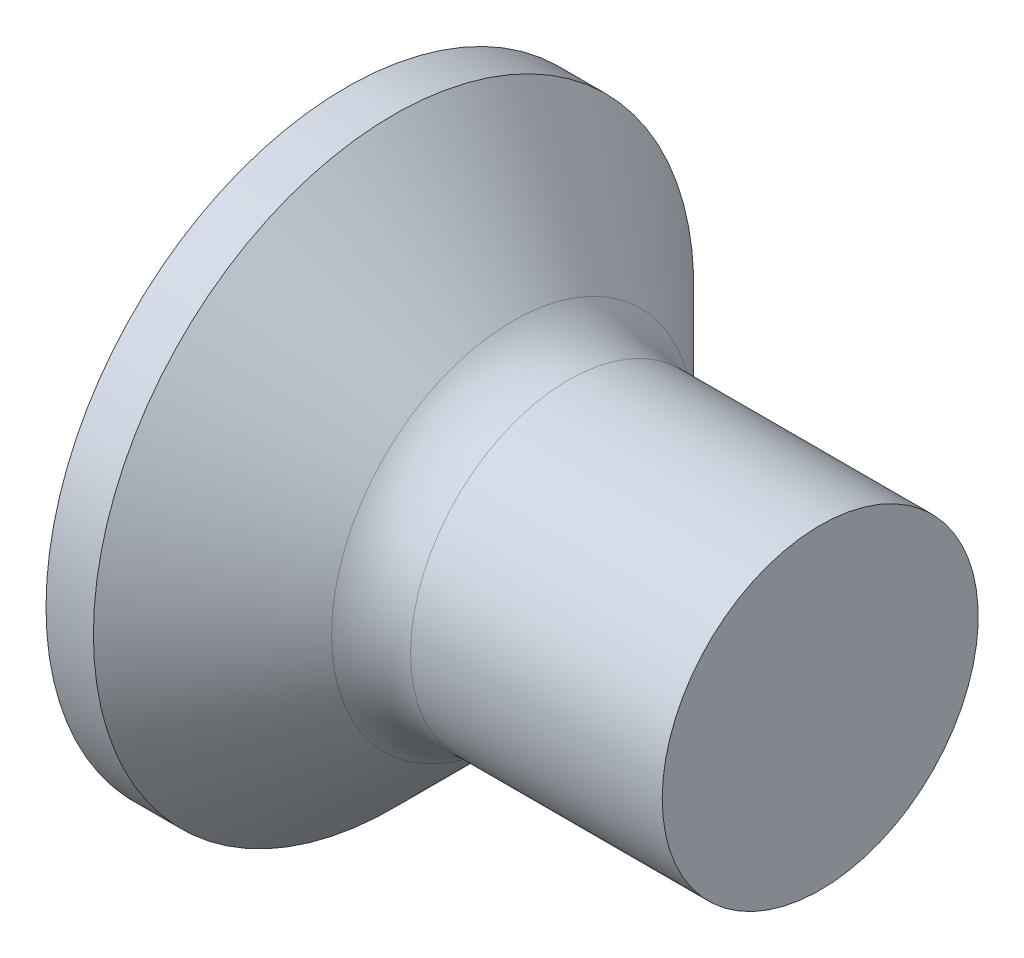
ISO-10303-21;
HEADER;
FILE_DESCRIPTION(('STEP AP214'),'2;1');
FILE_NAME('part.step','',(''),(''),'','','');
FILE_SCHEMA(('AUTOMOTIVE_DESIGN { 1 0 10303 214 1 1 1 1 }'));
ENDSEC;
DATA;
#1=APPLICATION_CONTEXT('core data for automotive mechanical design processes');
#2=APPLICATION_PROTOCOL_DEFINITION('international standard','automotive_design',2000,#1);
#3=PRODUCT_CONTEXT('',#1,'mechanical');
#4=PRODUCT('Part','Part','',(#3));
#5=PRODUCT_RELATED_PRODUCT_CATEGORY('part','',(#4));
#6=PRODUCT_DEFINITION_FORMATION('','',#4);
#7=PRODUCT_DEFINITION_CONTEXT('part definition',#1,'design');
#8=PRODUCT_DEFINITION('design','',#6,#7);
#9=PRODUCT_DEFINITION_SHAPE('','',#8);
#10=(LENGTH_UNIT() NAMED_UNIT(*) SI_UNIT(.MILLI.,.METRE.));
#11=(NAMED_UNIT(*) PLANE_ANGLE_UNIT() SI_UNIT($,.RADIAN.));
#12=(NAMED_UNIT(*) SI_UNIT($,.STERADIAN.) SOLID_ANGLE_UNIT());
#13=UNCERTAINTY_MEASURE_WITH_UNIT(LENGTH_MEASURE(1.E-05),#10,'distance_accuracy_value','');
#14=(GEOMETRIC_REPRESENTATION_CONTEXT(3) GLOBAL_UNCERTAINTY_ASSIGNED_CONTEXT((#13)) GLOBAL_UNIT_ASSIGNED_CONTEXT((#10,
#11,#12)) REPRESENTATION_CONTEXT('',''));
#15=CARTESIAN_POINT('',(0.,0.,0.));
#16=DIRECTION('',(0.,0.,1.));
#17=DIRECTION('',(1.,0.,0.));
#18=AXIS2_PLACEMENT_3D('',#15,#16,#17);
#19=CARTESIAN_POINT('',(0.,0.,0.));
#20=DIRECTION('',(-1.,0.,0.));
#21=DIRECTION('',(0.,0.,1.));
#22=AXIS2_PLACEMENT_3D('',#19,#20,#21);
#23=PLANE('',#22);
#24=CARTESIAN_POINT('',(0.,0.,0.));
#25=DIRECTION('',(-1.,0.,0.));
#26=DIRECTION('',(0.,0.,1.));
#27=AXIS2_PLACEMENT_3D('',#24,#25,#26);
#28=CIRCLE('',#27,1.9);
#29=CARTESIAN_POINT('',(0.,0.,1.9));
#30=VERTEX_POINT('',#29);
#31=EDGE_CURVE('E338',#30,#30,#28,.T.);
#32=ORIENTED_EDGE('',*,*,#31,.T.);
#33=EDGE_LOOP('',(#32));
#34=FACE_BOUND('',#33,.T.);
#35=DIRECTION('',(0.,0.,-1.));
#36=VECTOR('',#35,1.);
#37=CARTESIAN_POINT('',(0.,-0.240000000000003,0.95));
#38=LINE('',#37,#36);
#39=CARTESIAN_POINT('',(0.,-0.240000000000003,0.95));
#40=VERTEX_POINT('',#39);
#41=CARTESIAN_POINT('',(0.,-0.24,0.368080234393744));
#42=VERTEX_POINT('',#41);
#43=EDGE_CURVE('E378',#40,#42,#38,.T.);
#44=ORIENTED_EDGE('',*,*,#43,.T.);
#45=CARTESIAN_POINT('',(0.,0.,0.));
#46=DIRECTION('',(-1.,0.,0.));
#47=DIRECTION('',(0.,0.,1.));
#48=AXIS2_PLACEMENT_3D('',#45,#46,#47);
#49=CIRCLE('',#48,0.439412174332202);
#50=CARTESIAN_POINT('',(0.,-0.368080234393744,0.24));
#51=VERTEX_POINT('',#50);
#52=EDGE_CURVE('E366',#51,#42,#49,.T.);
#53=ORIENTED_EDGE('',*,*,#52,.F.);
#54=DIRECTION('',(0.,-1.,0.));
#55=VECTOR('',#54,1.);
#56=CARTESIAN_POINT('',(0.,0.95,0.24));
#57=LINE('',#56,#55);
#58=CARTESIAN_POINT('',(0.,-0.95,0.24));
#59=VERTEX_POINT('',#58);
#60=EDGE_CURVE('E425',#51,#59,#57,.T.);
#61=ORIENTED_EDGE('',*,*,#60,.T.);
#62=DIRECTION('',(0.,0.,-1.));
#63=VECTOR('',#62,1.);
#64=CARTESIAN_POINT('',(0.,-0.95,0.24));
#65=LINE('',#64,#63);
#66=CARTESIAN_POINT('',(0.,-0.95,-0.24));
#67=VERTEX_POINT('',#66);
#68=EDGE_CURVE('E335',#59,#67,#65,.T.);
#69=ORIENTED_EDGE('',*,*,#68,.T.);
#70=DIRECTION('',(0.,1.,0.));
#71=VECTOR('',#70,1.);
#72=CARTESIAN_POINT('',(0.,-0.95,-0.24));
#73=LINE('',#72,#71);
#74=CARTESIAN_POINT('',(0.,-0.368080234393745,-0.24));
#75=VERTEX_POINT('',#74);
#76=EDGE_CURVE('E426',#67,#75,#73,.T.);
#77=ORIENTED_EDGE('',*,*,#76,.T.);
#78=CARTESIAN_POINT('',(0.,-0.24,-0.368080234393745));
#79=VERTEX_POINT('',#78);
#80=EDGE_CURVE('E372',#79,#75,#49,.T.);
#81=ORIENTED_EDGE('',*,*,#80,.F.);
#82=CARTESIAN_POINT('',(0.,-0.239999999999997,-0.95));
#83=VERTEX_POINT('',#82);
#84=EDGE_CURVE('E387',#79,#83,#38,.T.);
#85=ORIENTED_EDGE('',*,*,#84,.T.);
#86=DIRECTION('',(0.,1.,0.));
#87=VECTOR('',#86,1.);
#88=CARTESIAN_POINT('',(0.,-0.239999999999997,-0.95));
#89=LINE('',#88,#87);
#90=CARTESIAN_POINT('',(0.,0.240000000000002,-0.95));
#91=VERTEX_POINT('',#90);
#92=EDGE_CURVE('E386',#83,#91,#89,.T.);
#93=ORIENTED_EDGE('',*,*,#92,.T.);
#94=DIRECTION('',(0.,0.,1.));
#95=VECTOR('',#94,1.);
#96=CARTESIAN_POINT('',(0.,0.240000000000002,-0.95));
#97=LINE('',#96,#95);
#98=CARTESIAN_POINT('',(0.,0.24,-0.368080234393744));
#99=VERTEX_POINT('',#98);
#100=EDGE_CURVE('E393',#91,#99,#97,.T.);
#101=ORIENTED_EDGE('',*,*,#100,.T.);
#102=CARTESIAN_POINT('',(0.,0.368080234393745,-0.24));
#103=VERTEX_POINT('',#102);
#104=EDGE_CURVE('E460',#103,#99,#49,.T.);
#105=ORIENTED_EDGE('',*,*,#104,.F.);
#106=CARTESIAN_POINT('',(0.,0.95,-0.24));
#107=VERTEX_POINT('',#106);
#108=EDGE_CURVE('E434',#103,#107,#73,.T.);
#109=ORIENTED_EDGE('',*,*,#108,.T.);
#110=DIRECTION('',(0.,0.,1.));
#111=VECTOR('',#110,1.);
#112=CARTESIAN_POINT('',(0.,0.95,-0.24));
#113=LINE('',#112,#111);
#114=CARTESIAN_POINT('',(0.,0.95,0.24));
#115=VERTEX_POINT('',#114);
#116=EDGE_CURVE('E422',#107,#115,#113,.T.);
#117=ORIENTED_EDGE('',*,*,#116,.T.);
#118=CARTESIAN_POINT('',(0.,0.368080234393745,0.24));
#119=VERTEX_POINT('',#118);
#120=EDGE_CURVE('E427',#115,#119,#57,.T.);
#121=ORIENTED_EDGE('',*,*,#120,.T.);
#122=CARTESIAN_POINT('',(0.,0.24,0.368080234393746));
#123=VERTEX_POINT('',#122);
#124=EDGE_CURVE('E374',#123,#119,#49,.T.);
#125=ORIENTED_EDGE('',*,*,#124,.F.);
#126=CARTESIAN_POINT('',(0.,0.239999999999996,0.95));
#127=VERTEX_POINT('',#126);
#128=EDGE_CURVE('E396',#123,#127,#97,.T.);
#129=ORIENTED_EDGE('',*,*,#128,.T.);
#130=DIRECTION('',(0.,-1.,0.));
#131=VECTOR('',#130,1.);
#132=CARTESIAN_POINT('',(0.,0.239999999999996,0.95));
#133=LINE('',#132,#131);
#134=EDGE_CURVE('E385',#127,#40,#133,.T.);
#135=ORIENTED_EDGE('',*,*,#134,.T.);
#136=EDGE_LOOP('',(#44,#53,#61,#69,#77,#81,#85,#93,#101,#105,#109,#117,#121,#125,#129,#135));
#137=FACE_BOUND('',#136,.T.);
#138=ADVANCED_FACE('F16',(#34,#137),#23,.T.);
#139=CARTESIAN_POINT('',(1.2,-0.351702090980209,0.24));
#140=DIRECTION('',(0.,0.,-1.));
#141=DIRECTION('',(-1.,0.,0.));
#142=AXIS2_PLACEMENT_3D('',#139,#140,#141);
#143=PLANE('',#142);
#144=ORIENTED_EDGE('',*,*,#60,.F.);
#145=CARTESIAN_POINT('',(-0.647693210410766,-0.421114336989016,0.24));
#146=CARTESIAN_POINT('',(-0.514503449530112,-0.410390261082209,0.24));
#147=CARTESIAN_POINT('',(-0.381320940222106,-0.399574318209685,0.24));
#148=CARTESIAN_POINT('',(-0.114973765651316,-0.377686644383828,0.24));
#149=CARTESIAN_POINT('',(0.0181908991098696,-0.36661490733336,0.24));
#150=CARTESIAN_POINT('',(0.284492634009301,-0.344144100394437,0.24));
#151=CARTESIAN_POINT('',(0.417629704158519,-0.332745030636384,0.24));
#152=CARTESIAN_POINT('',(0.683863247571635,-0.309504122508588,0.24));
#153=CARTESIAN_POINT('',(0.816959721449587,-0.297662291208839,0.24));
#154=CARTESIAN_POINT('',(1.04303435436914,-0.277010154535522,0.24));
#155=CARTESIAN_POINT('',(1.13602713244054,-0.268360479227263,0.24));
#156=CARTESIAN_POINT('',(1.32197255818582,-0.250648380042695,0.24));
#157=CARTESIAN_POINT('',(1.41492520621454,-0.241585959894736,0.24));
#158=CARTESIAN_POINT('',(1.60078125424125,-0.222904447219645,0.24));
#159=CARTESIAN_POINT('',(1.69368465085292,-0.2132853204365,0.24));
#160=CARTESIAN_POINT('',(1.8793987441832,-0.193166747196935,0.24));
#161=CARTESIAN_POINT('',(1.97220943765284,-0.182667270911615,0.24));
#162=CARTESIAN_POINT('',(2.06495176785102,-0.171565852394699,0.24));
#163=B_SPLINE_CURVE_WITH_KNOTS('',3,(#145,#146,#147,#148,#149,#150,#151,#152,#153,#154,#155,
#156,#157,#158,#159,#160,#161,#162),.UNSPECIFIED.,.F.,.F.,(4,2,2,2,2,2,2,2,4),(0.,
0.400862588720512,0.801734742318302,1.20260673621982,1.60347233174809,1.88365413958718,
2.16383341702737,2.44402995319874,2.72423598711459),.UNSPECIFIED.);
#164=CARTESIAN_POINT('',(1.2,-0.262259890185287,0.24));
#165=VERTEX_POINT('',#164);
#166=EDGE_CURVE('E369',#51,#165,#163,.T.);
#167=ORIENTED_EDGE('',*,*,#166,.T.);
#168=DIRECTION('',(0.,-1.,0.));
#169=VECTOR('',#168,1.);
#170=CARTESIAN_POINT('',(1.2,0.351702090980209,0.24));
#171=LINE('',#170,#169);
#172=CARTESIAN_POINT('',(1.2,-0.351702090980209,0.24));
#173=VERTEX_POINT('',#172);
#174=EDGE_CURVE('E441',#165,#173,#171,.T.);
#175=ORIENTED_EDGE('',*,*,#174,.T.);
#176=DIRECTION('',(0.894934367749961,0.446197800778957,0.));
#177=VECTOR('',#176,1.);
#178=CARTESIAN_POINT('',(0.,-0.95,0.24));
#179=LINE('',#178,#177);
#180=EDGE_CURVE('E313',#59,#173,#179,.T.);
#181=ORIENTED_EDGE('',*,*,#180,.F.);
#182=EDGE_LOOP('',(#144,#167,#175,#181));
#183=FACE_BOUND('',#182,.T.);
#184=ADVANCED_FACE('F172',(#183),#143,.T.);
#185=CARTESIAN_POINT('',(1.2,0.351702090980209,0.24));
#186=VERTEX_POINT('',#185);
#187=CARTESIAN_POINT('',(1.2,0.262259890185287,0.24));
#188=VERTEX_POINT('',#187);
#189=EDGE_CURVE('E322',#186,#188,#171,.T.);
#190=ORIENTED_EDGE('',*,*,#189,.T.);
#191=CARTESIAN_POINT('',(-0.647693210410766,0.421114336989016,0.24));
#192=CARTESIAN_POINT('',(-0.514503449530111,0.410390261082209,0.239999999999999));
#193=CARTESIAN_POINT('',(-0.381320940222105,0.399574318209685,0.239999999999999));
#194=CARTESIAN_POINT('',(-0.114973765651316,0.377686644383828,0.24));
#195=CARTESIAN_POINT('',(0.0181908991098701,0.36661490733336,0.24));
#196=CARTESIAN_POINT('',(0.284492634009302,0.344144100394437,0.24));
#197=CARTESIAN_POINT('',(0.417629704158519,0.332745030636384,0.24));
#198=CARTESIAN_POINT('',(0.683863247571635,0.309504122508588,0.24));
#199=CARTESIAN_POINT('',(0.816959721449588,0.297662291208839,0.24));
#200=CARTESIAN_POINT('',(1.04303435436914,0.277010154535523,0.24));
#201=CARTESIAN_POINT('',(1.13602713244054,0.268360479227263,0.24));
#202=CARTESIAN_POINT('',(1.32197255818582,0.250648380042694,0.24));
#203=CARTESIAN_POINT('',(1.41492520621454,0.241585959894736,0.24));
#204=CARTESIAN_POINT('',(1.60078125424125,0.222904447219645,0.24));
#205=CARTESIAN_POINT('',(1.69368465085292,0.2132853204365,0.24));
#206=CARTESIAN_POINT('',(1.8793987441832,0.193166747196935,0.24));
#207=CARTESIAN_POINT('',(1.97220943765284,0.182667270911615,0.24));
#208=CARTESIAN_POINT('',(2.06495176785102,0.171565852394699,0.24));
#209=B_SPLINE_CURVE_WITH_KNOTS('',3,(#191,#192,#193,#194,#195,#196,#197,#198,#199,#200,#201,
#202,#203,#204,#205,#206,#207,#208),.UNSPECIFIED.,.F.,.F.,(4,2,2,2,2,2,2,2,4),(0.,
0.400862588720512,0.801734742318303,1.20260673621982,1.60347233174809,1.88365413958718,
2.16383341702737,2.44402995319874,2.72423598711459),.UNSPECIFIED.);
#210=EDGE_CURVE('E235',#188,#119,#209,.F.);
#211=ORIENTED_EDGE('',*,*,#210,.T.);
#212=ORIENTED_EDGE('',*,*,#120,.F.);
#213=DIRECTION('',(0.89493436774996,-0.446197800778958,0.));
#214=VECTOR('',#213,1.);
#215=CARTESIAN_POINT('',(0.,0.95,0.24));
#216=LINE('',#215,#214);
#217=EDGE_CURVE('E39',#115,#186,#216,.T.);
#218=ORIENTED_EDGE('',*,*,#217,.T.);
#219=EDGE_LOOP('',(#190,#211,#212,#218));
#220=FACE_BOUND('',#219,.T.);
#221=ADVANCED_FACE('F178',(#220),#143,.T.);
#222=CARTESIAN_POINT('',(1.2,0.351702090980209,-0.24));
#223=DIRECTION('',(0.,0.,1.));
#224=DIRECTION('',(1.,0.,0.));
#225=AXIS2_PLACEMENT_3D('',#222,#223,#224);
#226=PLANE('',#225);
#227=DIRECTION('',(0.,1.,0.));
#228=VECTOR('',#227,1.);
#229=CARTESIAN_POINT('',(1.2,-0.351702090980209,-0.24));
#230=LINE('',#229,#228);
#231=CARTESIAN_POINT('',(1.2,-0.351702090980209,-0.24));
#232=VERTEX_POINT('',#231);
#233=CARTESIAN_POINT('',(1.2,-0.262259890185288,-0.24));
#234=VERTEX_POINT('',#233);
#235=EDGE_CURVE('E326',#232,#234,#230,.T.);
#236=ORIENTED_EDGE('',*,*,#235,.T.);
#237=CARTESIAN_POINT('',(-0.647693210410766,-0.421114336989016,-0.24));
#238=CARTESIAN_POINT('',(-0.514503449530111,-0.410390261082209,-0.239999999999999));
#239=CARTESIAN_POINT('',(-0.381320940222105,-0.399574318209685,-0.239999999999999));
#240=CARTESIAN_POINT('',(-0.114973765651316,-0.377686644383829,-0.239999999999999));
#241=CARTESIAN_POINT('',(0.0181908991098696,-0.36661490733336,-0.24));
#242=CARTESIAN_POINT('',(0.284492634009301,-0.344144100394437,-0.24));
#243=CARTESIAN_POINT('',(0.417629704158519,-0.332745030636384,-0.24));
#244=CARTESIAN_POINT('',(0.683863247571635,-0.309504122508588,-0.24));
#245=CARTESIAN_POINT('',(0.816959721449587,-0.297662291208839,-0.24));
#246=CARTESIAN_POINT('',(1.04303435436914,-0.277010154535523,-0.24));
#247=CARTESIAN_POINT('',(1.13602713244054,-0.268360479227263,-0.24));
#248=CARTESIAN_POINT('',(1.32197255818582,-0.250648380042694,-0.24));
#249=CARTESIAN_POINT('',(1.41492520621454,-0.241585959894736,-0.24));
#250=CARTESIAN_POINT('',(1.60078125424125,-0.222904447219645,-0.24));
#251=CARTESIAN_POINT('',(1.69368465085292,-0.2132853204365,-0.24));
#252=CARTESIAN_POINT('',(1.8793987441832,-0.193166747196935,-0.24));
#253=CARTESIAN_POINT('',(1.97220943765284,-0.182667270911614,-0.24));
#254=CARTESIAN_POINT('',(2.06495176785102,-0.171565852394699,-0.24));
#255=B_SPLINE_CURVE_WITH_KNOTS('',3,(#237,#238,#239,#240,#241,#242,#243,#244,#245,#246,#247,
#248,#249,#250,#251,#252,#253,#254),.UNSPECIFIED.,.F.,.F.,(4,2,2,2,2,2,2,2,4),(0.,
0.400862588720512,0.801734742318302,1.20260673621982,1.60347233174809,1.88365413958718,
2.16383341702737,2.44402995319874,2.72423598711459),.UNSPECIFIED.);
#256=EDGE_CURVE('E228',#234,#75,#255,.F.);
#257=ORIENTED_EDGE('',*,*,#256,.T.);
#258=ORIENTED_EDGE('',*,*,#76,.F.);
#259=DIRECTION('',(0.894934367749961,0.446197800778957,0.));
#260=VECTOR('',#259,1.);
#261=CARTESIAN_POINT('',(0.,-0.95,-0.24));
#262=LINE('',#261,#260);
#263=EDGE_CURVE('E436',#67,#232,#262,.T.);
#264=ORIENTED_EDGE('',*,*,#263,.T.);
#265=EDGE_LOOP('',(#236,#257,#258,#264));
#266=FACE_BOUND('',#265,.T.);
#267=ADVANCED_FACE('F213',(#266),#226,.T.);
#268=ORIENTED_EDGE('',*,*,#108,.F.);
#269=CARTESIAN_POINT('',(-0.647693210410766,0.421114336989016,-0.24));
#270=CARTESIAN_POINT('',(-0.514503449530111,0.410390261082209,-0.239999999999999));
#271=CARTESIAN_POINT('',(-0.381320940222105,0.399574318209685,-0.239999999999999));
#272=CARTESIAN_POINT('',(-0.114973765651316,0.377686644383829,-0.239999999999999));
#273=CARTESIAN_POINT('',(0.0181908991098696,0.36661490733336,-0.24));
#274=CARTESIAN_POINT('',(0.284492634009301,0.344144100394437,-0.24));
#275=CARTESIAN_POINT('',(0.417629704158519,0.332745030636384,-0.24));
#276=CARTESIAN_POINT('',(0.683863247571635,0.309504122508588,-0.24));
#277=CARTESIAN_POINT('',(0.816959721449587,0.297662291208839,-0.24));
#278=CARTESIAN_POINT('',(1.04303435436914,0.277010154535523,-0.24));
#279=CARTESIAN_POINT('',(1.13602713244054,0.268360479227263,-0.24));
#280=CARTESIAN_POINT('',(1.32197255818582,0.250648380042694,-0.24));
#281=CARTESIAN_POINT('',(1.41492520621454,0.241585959894736,-0.24));
#282=CARTESIAN_POINT('',(1.60078125424125,0.222904447219645,-0.24));
#283=CARTESIAN_POINT('',(1.69368465085292,0.2132853204365,-0.24));
#284=CARTESIAN_POINT('',(1.8793987441832,0.193166747196935,-0.24));
#285=CARTESIAN_POINT('',(1.97220943765284,0.182667270911614,-0.24));
#286=CARTESIAN_POINT('',(2.06495176785102,0.171565852394699,-0.24));
#287=B_SPLINE_CURVE_WITH_KNOTS('',3,(#269,#270,#271,#272,#273,#274,#275,#276,#277,#278,#279,
#280,#281,#282,#283,#284,#285,#286),.UNSPECIFIED.,.F.,.F.,(4,2,2,2,2,2,2,2,4),(0.,
0.400862588720512,0.801734742318302,1.20260673621982,1.60347233174809,1.88365413958718,
2.16383341702737,2.44402995319874,2.72423598711459),.UNSPECIFIED.);
#288=CARTESIAN_POINT('',(1.2,0.262259890185288,-0.24));
#289=VERTEX_POINT('',#288);
#290=EDGE_CURVE('E221',#103,#289,#287,.T.);
#291=ORIENTED_EDGE('',*,*,#290,.T.);
#292=CARTESIAN_POINT('',(1.2,0.351702090980209,-0.24));
#293=VERTEX_POINT('',#292);
#294=EDGE_CURVE('E330',#289,#293,#230,.T.);
#295=ORIENTED_EDGE('',*,*,#294,.T.);
#296=DIRECTION('',(0.89493436774996,-0.446197800778958,0.));
#297=VECTOR('',#296,1.);
#298=CARTESIAN_POINT('',(0.,0.95,-0.24));
#299=LINE('',#298,#297);
#300=EDGE_CURVE('E317',#107,#293,#299,.T.);
#301=ORIENTED_EDGE('',*,*,#300,.F.);
#302=EDGE_LOOP('',(#268,#291,#295,#301));
#303=FACE_BOUND('',#302,.T.);
#304=ADVANCED_FACE('F205',(#303),#226,.T.);
#305=CARTESIAN_POINT('',(1.2,-0.351702090980209,-0.24));
#306=DIRECTION('',(-1.,0.,0.));
#307=DIRECTION('',(0.,0.,1.));
#308=AXIS2_PLACEMENT_3D('',#305,#306,#307);
#309=PLANE('',#308);
#310=DIRECTION('',(0.,-1.,0.));
#311=VECTOR('',#310,1.);
#312=CARTESIAN_POINT('',(1.2,0.24,0.35170209098021));
#313=LINE('',#312,#311);
#314=CARTESIAN_POINT('',(1.2,-0.0518255651213487,0.351702090980209));
#315=VERTEX_POINT('',#314);
#316=CARTESIAN_POINT('',(1.2,-0.24,0.351702090980208));
#317=VERTEX_POINT('',#316);
#318=EDGE_CURVE('E413',#315,#317,#313,.T.);
#319=ORIENTED_EDGE('',*,*,#318,.F.);
#320=CARTESIAN_POINT('',(1.2,0.,0.));
#321=DIRECTION('',(-1.,0.,0.));
#322=DIRECTION('',(0.,0.,1.));
#323=AXIS2_PLACEMENT_3D('',#320,#321,#322);
#324=CIRCLE('',#323,0.3555);
#325=CARTESIAN_POINT('',(1.2,-0.24,0.262259890185287));
#326=VERTEX_POINT('',#325);
#327=EDGE_CURVE('E31',#326,#315,#324,.T.);
#328=ORIENTED_EDGE('',*,*,#327,.F.);
#329=DIRECTION('',(0.,0.,-1.));
#330=VECTOR('',#329,1.);
#331=CARTESIAN_POINT('',(1.2,-0.24,0.351702090980208));
#332=LINE('',#331,#330);
#333=EDGE_CURVE('E381',#317,#326,#332,.T.);
#334=ORIENTED_EDGE('',*,*,#333,.F.);
#335=EDGE_LOOP('',(#319,#328,#334));
#336=FACE_BOUND('',#335,.T.);
#337=ADVANCED_FACE('F201',(#336),#309,.T.);
#338=ORIENTED_EDGE('',*,*,#174,.F.);
#339=CARTESIAN_POINT('',(1.2,-0.351702090980209,0.0518255651213523));
#340=VERTEX_POINT('',#339);
#341=EDGE_CURVE('E473',#340,#165,#324,.T.);
#342=ORIENTED_EDGE('',*,*,#341,.F.);
#343=DIRECTION('',(0.,0.,-1.));
#344=VECTOR('',#343,1.);
#345=CARTESIAN_POINT('',(1.2,-0.351702090980209,0.24));
#346=LINE('',#345,#344);
#347=EDGE_CURVE('E308',#173,#340,#346,.T.);
#348=ORIENTED_EDGE('',*,*,#347,.F.);
#349=EDGE_LOOP('',(#338,#342,#348));
#350=FACE_BOUND('',#349,.T.);
#351=ADVANCED_FACE('F204',(#350),#309,.T.);
#352=CARTESIAN_POINT('',(1.2,-0.351702090980209,-0.0518255651213523));
#353=VERTEX_POINT('',#352);
#354=EDGE_CURVE('E318',#353,#232,#346,.T.);
#355=ORIENTED_EDGE('',*,*,#354,.F.);
#356=EDGE_CURVE('E477',#234,#353,#324,.T.);
#357=ORIENTED_EDGE('',*,*,#356,.F.);
#358=ORIENTED_EDGE('',*,*,#235,.F.);
#359=EDGE_LOOP('',(#355,#357,#358));
#360=FACE_BOUND('',#359,.T.);
#361=ADVANCED_FACE('F513',(#360),#309,.T.);
#362=CARTESIAN_POINT('',(1.2,-0.24,-0.262259890185289));
#363=VERTEX_POINT('',#362);
#364=CARTESIAN_POINT('',(1.2,-0.24,-0.35170209098021));
#365=VERTEX_POINT('',#364);
#366=EDGE_CURVE('E412',#363,#365,#332,.T.);
#367=ORIENTED_EDGE('',*,*,#366,.F.);
#368=CARTESIAN_POINT('',(1.2,-0.0518255651213511,-0.35170209098021));
#369=VERTEX_POINT('',#368);
#370=EDGE_CURVE('E506',#369,#363,#324,.T.);
#371=ORIENTED_EDGE('',*,*,#370,.F.);
#372=DIRECTION('',(0.,1.,0.));
#373=VECTOR('',#372,1.);
#374=CARTESIAN_POINT('',(1.2,-0.24,-0.35170209098021));
#375=LINE('',#374,#373);
#376=EDGE_CURVE('E408',#365,#369,#375,.T.);
#377=ORIENTED_EDGE('',*,*,#376,.F.);
#378=EDGE_LOOP('',(#367,#371,#377));
#379=FACE_BOUND('',#378,.T.);
#380=ADVANCED_FACE('F515',(#379),#309,.T.);
#381=CARTESIAN_POINT('',(1.2,0.0518255651213535,-0.351702090980209));
#382=VERTEX_POINT('',#381);
#383=CARTESIAN_POINT('',(1.2,0.24,-0.351702090980208));
#384=VERTEX_POINT('',#383);
#385=EDGE_CURVE('E415',#382,#384,#375,.T.);
#386=ORIENTED_EDGE('',*,*,#385,.F.);
#387=CARTESIAN_POINT('',(1.2,0.24,-0.262259890185287));
#388=VERTEX_POINT('',#387);
#389=EDGE_CURVE('E500',#388,#382,#324,.T.);
#390=ORIENTED_EDGE('',*,*,#389,.F.);
#391=DIRECTION('',(0.,0.,1.));
#392=VECTOR('',#391,1.);
#393=CARTESIAN_POINT('',(1.2,0.24,-0.351702090980208));
#394=LINE('',#393,#392);
#395=EDGE_CURVE('E418',#384,#388,#394,.T.);
#396=ORIENTED_EDGE('',*,*,#395,.F.);
#397=EDGE_LOOP('',(#386,#390,#396));
#398=FACE_BOUND('',#397,.T.);
#399=ADVANCED_FACE('F521',(#398),#309,.T.);
#400=ORIENTED_EDGE('',*,*,#294,.F.);
#401=CARTESIAN_POINT('',(1.2,0.351702090980209,-0.0518255651213531));
#402=VERTEX_POINT('',#401);
#403=EDGE_CURVE('E458',#402,#289,#324,.T.);
#404=ORIENTED_EDGE('',*,*,#403,.F.);
#405=DIRECTION('',(0.,0.,1.));
#406=VECTOR('',#405,1.);
#407=CARTESIAN_POINT('',(1.2,0.351702090980209,-0.24));
#408=LINE('',#407,#406);
#409=EDGE_CURVE('E439',#293,#402,#408,.T.);
#410=ORIENTED_EDGE('',*,*,#409,.F.);
#411=EDGE_LOOP('',(#400,#404,#410));
#412=FACE_BOUND('',#411,.T.);
#413=ADVANCED_FACE('F496',(#412),#309,.T.);
#414=CARTESIAN_POINT('',(1.2,0.351702090980209,0.0518255651213531));
#415=VERTEX_POINT('',#414);
#416=EDGE_CURVE('E329',#415,#186,#408,.T.);
#417=ORIENTED_EDGE('',*,*,#416,.F.);
#418=EDGE_CURVE('E452',#188,#415,#324,.T.);
#419=ORIENTED_EDGE('',*,*,#418,.F.);
#420=ORIENTED_EDGE('',*,*,#189,.F.);
#421=EDGE_LOOP('',(#417,#419,#420));
#422=FACE_BOUND('',#421,.T.);
#423=ADVANCED_FACE('F302',(#422),#309,.T.);
#424=CARTESIAN_POINT('',(1.2,0.24,0.262259890185289));
#425=VERTEX_POINT('',#424);
#426=CARTESIAN_POINT('',(1.2,0.24,0.35170209098021));
#427=VERTEX_POINT('',#426);
#428=EDGE_CURVE('E421',#425,#427,#394,.T.);
#429=ORIENTED_EDGE('',*,*,#428,.F.);
#430=CARTESIAN_POINT('',(1.2,0.0518255651213519,0.351702090980209));
#431=VERTEX_POINT('',#430);
#432=EDGE_CURVE('E373',#431,#425,#324,.T.);
#433=ORIENTED_EDGE('',*,*,#432,.F.);
#434=EDGE_CURVE('E409',#427,#431,#313,.T.);
#435=ORIENTED_EDGE('',*,*,#434,.F.);
#436=EDGE_LOOP('',(#429,#433,#435));
#437=FACE_BOUND('',#436,.T.);
#438=ADVANCED_FACE('F207',(#437),#309,.T.);
#439=CARTESIAN_POINT('',(1.2,-0.351702090980209,-0.24));
#440=DIRECTION('',(-0.446197800778957,0.894934367749961,0.));
#441=DIRECTION('',(-0.894934367749961,-0.446197800778957,0.));
#442=AXIS2_PLACEMENT_3D('',#439,#440,#441);
#443=PLANE('',#442);
#444=ORIENTED_EDGE('',*,*,#347,.T.);
#445=CARTESIAN_POINT('',(1.81755030037572,-0.0438028797890928,0.));
#446=DIRECTION('',(-0.446197800778957,0.894934367749961,0.));
#447=DIRECTION('',(-0.894934367749961,-0.446197800778957,0.));
#448=AXIS2_PLACEMENT_3D('',#445,#446,#447);
#449=ELLIPSE('',#448,0.699951178008362,0.309229710740657);
#450=EDGE_CURVE('E309',#340,#353,#449,.F.);
#451=ORIENTED_EDGE('',*,*,#450,.T.);
#452=ORIENTED_EDGE('',*,*,#354,.T.);
#453=ORIENTED_EDGE('',*,*,#263,.F.);
#454=ORIENTED_EDGE('',*,*,#68,.F.);
#455=ORIENTED_EDGE('',*,*,#180,.T.);
#456=EDGE_LOOP('',(#444,#451,#452,#453,#454,#455));
#457=FACE_BOUND('',#456,.T.);
#458=ADVANCED_FACE('F212',(#457),#443,.T.);
#459=CARTESIAN_POINT('',(0.,0.95,0.24));
#460=DIRECTION('',(-0.446197800778958,-0.89493436774996,0.));
#461=DIRECTION('',(0.89493436774996,-0.446197800778958,0.));
#462=AXIS2_PLACEMENT_3D('',#459,#460,#461);
#463=PLANE('',#462);
#464=ORIENTED_EDGE('',*,*,#409,.T.);
#465=CARTESIAN_POINT('',(1.81755030037572,0.0438028797890926,0.));
#466=DIRECTION('',(-0.446197800778958,-0.89493436774996,0.));
#467=DIRECTION('',(-0.89493436774996,0.446197800778958,0.));
#468=AXIS2_PLACEMENT_3D('',#465,#466,#467);
#469=ELLIPSE('',#468,0.699951178008361,0.309229710740658);
#470=EDGE_CURVE('E281',#402,#415,#469,.F.);
#471=ORIENTED_EDGE('',*,*,#470,.T.);
#472=ORIENTED_EDGE('',*,*,#416,.T.);
#473=ORIENTED_EDGE('',*,*,#217,.F.);
#474=ORIENTED_EDGE('',*,*,#116,.F.);
#475=ORIENTED_EDGE('',*,*,#300,.T.);
#476=EDGE_LOOP('',(#464,#471,#472,#473,#474,#475));
#477=FACE_BOUND('',#476,.T.);
#478=ADVANCED_FACE('F208',(#477),#463,.T.);
#479=CARTESIAN_POINT('',(1.2,-0.24,-0.35170209098021));
#480=DIRECTION('',(0.,1.,0.));
#481=DIRECTION('',(-1.,0.,0.));
#482=AXIS2_PLACEMENT_3D('',#479,#480,#481);
#483=PLANE('',#482);
#484=ORIENTED_EDGE('',*,*,#84,.F.);
#485=CARTESIAN_POINT('',(-0.647693210421637,-0.24,-0.421114336989891));
#486=CARTESIAN_POINT('',(-0.514503449539821,-0.239999999999999,-0.410390261082995));
#487=CARTESIAN_POINT('',(-0.381320940230653,-0.239999999999999,-0.399574318210383));
#488=CARTESIAN_POINT('',(-0.114973765657541,-0.24,-0.377686644384345));
#489=CARTESIAN_POINT('',(0.0181908991048065,-0.24,-0.366614907333785));
#490=CARTESIAN_POINT('',(0.284492634007953,-0.24,-0.344144100394555));
#491=CARTESIAN_POINT('',(0.417629704159725,-0.24,-0.332745030636283));
#492=CARTESIAN_POINT('',(0.683863247577946,-0.24,-0.309504122508033));
#493=CARTESIAN_POINT('',(0.816959721458451,-0.24,-0.297662291208049));
#494=CARTESIAN_POINT('',(1.04303435438055,-0.24,-0.277010154534468));
#495=CARTESIAN_POINT('',(1.13602713245196,-0.24,-0.268360479226193));
#496=CARTESIAN_POINT('',(1.32197255819723,-0.24,-0.25064838004159));
#497=CARTESIAN_POINT('',(1.41492520622595,-0.24,-0.241585959893612));
#498=CARTESIAN_POINT('',(1.60078125425266,-0.240000000000001,-0.222904447218474));
#499=CARTESIAN_POINT('',(1.69368465086432,-0.240000000000001,-0.213285320435301));
#500=CARTESIAN_POINT('',(1.87939874419459,-0.240000000000001,-0.193166747195666));
#501=CARTESIAN_POINT('',(1.97220943766423,-0.24,-0.182667270910302));
#502=CARTESIAN_POINT('',(2.06495176786241,-0.24,-0.171565852393331));
#503=B_SPLINE_CURVE_WITH_KNOTS('',3,(#485,#486,#487,#488,#489,#490,#491,#492,#493,#494,#495,
#496,#497,#498,#499,#500,#501,#502),.UNSPECIFIED.,.F.,.F.,(4,2,2,2,2,2,2,2,4),(0.,
0.400862588724007,0.801734742325293,1.2026067362345,1.60347233177046,1.88365413960954,
2.16383341704974,2.44402995322111,2.72423598713696),.UNSPECIFIED.);
#504=EDGE_CURVE('E273',#79,#363,#503,.T.);
#505=ORIENTED_EDGE('',*,*,#504,.T.);
#506=ORIENTED_EDGE('',*,*,#366,.T.);
#507=DIRECTION('',(0.894934367749961,0.,0.446197800778957));
#508=VECTOR('',#507,1.);
#509=CARTESIAN_POINT('',(0.,-0.239999999999997,-0.95));
#510=LINE('',#509,#508);
#511=EDGE_CURVE('E397',#83,#365,#510,.T.);
#512=ORIENTED_EDGE('',*,*,#511,.F.);
#513=EDGE_LOOP('',(#484,#505,#506,#512));
#514=FACE_BOUND('',#513,.T.);
#515=ADVANCED_FACE('F211',(#514),#483,.T.);
#516=CARTESIAN_POINT('',(1.2,0.24,0.35170209098021));
#517=DIRECTION('',(0.,-1.,0.));
#518=DIRECTION('',(1.,0.,0.));
#519=AXIS2_PLACEMENT_3D('',#516,#517,#518);
#520=PLANE('',#519);
#521=ORIENTED_EDGE('',*,*,#395,.T.);
#522=CARTESIAN_POINT('',(-0.647693210410766,0.24,-0.421114336989015));
#523=CARTESIAN_POINT('',(-0.514503449530111,0.240000000000003,-0.410390261082207));
#524=CARTESIAN_POINT('',(-0.381320940222106,0.240000000000003,-0.399574318209683));
#525=CARTESIAN_POINT('',(-0.114973765651316,0.240000000000001,-0.377686644383827));
#526=CARTESIAN_POINT('',(0.0181908991098696,0.24,-0.36661490733336));
#527=CARTESIAN_POINT('',(0.284492634009301,0.24,-0.344144100394436));
#528=CARTESIAN_POINT('',(0.417629704158519,0.240000000000002,-0.332745030636382));
#529=CARTESIAN_POINT('',(0.683863247571634,0.240000000000002,-0.309504122508586));
#530=CARTESIAN_POINT('',(0.816959721449587,0.24,-0.297662291208839));
#531=CARTESIAN_POINT('',(1.04303435436914,0.24,-0.277010154535522));
#532=CARTESIAN_POINT('',(1.13602713244054,0.240000000000002,-0.268360479227262));
#533=CARTESIAN_POINT('',(1.32197255818582,0.240000000000003,-0.250648380042692));
#534=CARTESIAN_POINT('',(1.41492520621454,0.240000000000002,-0.241585959894734));
#535=CARTESIAN_POINT('',(1.60078125424125,0.240000000000002,-0.222904447219642));
#536=CARTESIAN_POINT('',(1.69368465085292,0.240000000000002,-0.213285320436498));
#537=CARTESIAN_POINT('',(1.8793987441832,0.240000000000002,-0.193166747196933));
#538=CARTESIAN_POINT('',(1.97220943765284,0.240000000000002,-0.182667270911613));
#539=CARTESIAN_POINT('',(2.06495176785102,0.24,-0.171565852394698));
#540=B_SPLINE_CURVE_WITH_KNOTS('',3,(#522,#523,#524,#525,#526,#527,#528,#529,#530,#531,#532,
#533,#534,#535,#536,#537,#538,#539),.UNSPECIFIED.,.F.,.F.,(4,2,2,2,2,2,2,2,4),(0.,
0.400862588720512,0.801734742318302,1.20260673621982,1.60347233174809,1.88365413958718,
2.16383341702737,2.44402995319874,2.72423598711459),.UNSPECIFIED.);
#541=EDGE_CURVE('E266',#388,#99,#540,.F.);
#542=ORIENTED_EDGE('',*,*,#541,.T.);
#543=ORIENTED_EDGE('',*,*,#100,.F.);
#544=DIRECTION('',(0.894934367749961,0.,0.446197800778957));
#545=VECTOR('',#544,1.);
#546=CARTESIAN_POINT('',(0.,0.240000000000002,-0.95));
#547=LINE('',#546,#545);
#548=EDGE_CURVE('E400',#91,#384,#547,.T.);
#549=ORIENTED_EDGE('',*,*,#548,.T.);
#550=EDGE_LOOP('',(#521,#542,#543,#549));
#551=FACE_BOUND('',#550,.T.);
#552=ADVANCED_FACE('F284',(#551),#520,.T.);
#553=CARTESIAN_POINT('',(1.2,0.24,-0.351702090980208));
#554=DIRECTION('',(-0.446197800778957,0.,0.894934367749961));
#555=DIRECTION('',(-0.894934367749961,0.,-0.446197800778957));
#556=AXIS2_PLACEMENT_3D('',#553,#554,#555);
#557=PLANE('',#556);
#558=ORIENTED_EDGE('',*,*,#376,.T.);
#559=CARTESIAN_POINT('',(1.81755030037572,0.,-0.0438028797890928));
#560=DIRECTION('',(-0.446197800778957,0.,0.894934367749961));
#561=DIRECTION('',(-0.894934367749961,0.,-0.446197800778957));
#562=AXIS2_PLACEMENT_3D('',#559,#560,#561);
#563=ELLIPSE('',#562,0.699951178008362,0.309229710740657);
#564=EDGE_CURVE('E382',#369,#382,#563,.F.);
#565=ORIENTED_EDGE('',*,*,#564,.T.);
#566=ORIENTED_EDGE('',*,*,#385,.T.);
#567=ORIENTED_EDGE('',*,*,#548,.F.);
#568=ORIENTED_EDGE('',*,*,#92,.F.);
#569=ORIENTED_EDGE('',*,*,#511,.T.);
#570=EDGE_LOOP('',(#558,#565,#566,#567,#568,#569));
#571=FACE_BOUND('',#570,.T.);
#572=ADVANCED_FACE('F243',(#571),#557,.T.);
#573=ORIENTED_EDGE('',*,*,#333,.T.);
#574=CARTESIAN_POINT('',(-0.647693210410766,-0.24,0.421114336989015));
#575=CARTESIAN_POINT('',(-0.514503449530111,-0.240000000000003,0.410390261082207));
#576=CARTESIAN_POINT('',(-0.381320940222106,-0.240000000000003,0.399574318209683));
#577=CARTESIAN_POINT('',(-0.114973765651316,-0.240000000000001,0.377686644383827));
#578=CARTESIAN_POINT('',(0.0181908991098696,-0.24,0.366614907333359));
#579=CARTESIAN_POINT('',(0.284492634009301,-0.24,0.344144100394436));
#580=CARTESIAN_POINT('',(0.417629704158519,-0.240000000000002,0.332745030636382));
#581=CARTESIAN_POINT('',(0.683863247571635,-0.240000000000002,0.309504122508586));
#582=CARTESIAN_POINT('',(0.816959721449587,-0.24,0.297662291208839));
#583=CARTESIAN_POINT('',(1.04303435436914,-0.24,0.277010154535521));
#584=CARTESIAN_POINT('',(1.13602713244054,-0.240000000000002,0.268360479227262));
#585=CARTESIAN_POINT('',(1.32197255818582,-0.240000000000003,0.250648380042692));
#586=CARTESIAN_POINT('',(1.41492520621454,-0.240000000000002,0.241585959894734));
#587=CARTESIAN_POINT('',(1.60078125424125,-0.240000000000002,0.222904447219643));
#588=CARTESIAN_POINT('',(1.69368465085292,-0.240000000000002,0.213285320436498));
#589=CARTESIAN_POINT('',(1.8793987441832,-0.240000000000002,0.193166747196933));
#590=CARTESIAN_POINT('',(1.97220943765284,-0.240000000000001,0.182667270911613));
#591=CARTESIAN_POINT('',(2.06495176785102,-0.24,0.171565852394698));
#592=B_SPLINE_CURVE_WITH_KNOTS('',3,(#574,#575,#576,#577,#578,#579,#580,#581,#582,#583,#584,
#585,#586,#587,#588,#589,#590,#591),.UNSPECIFIED.,.F.,.F.,(4,2,2,2,2,2,2,2,4),(0.,
0.400862588720512,0.801734742318302,1.20260673621982,1.60347233174809,1.88365413958718,
2.16383341702737,2.44402995319874,2.72423598711459),.UNSPECIFIED.);
#593=EDGE_CURVE('E258',#326,#42,#592,.F.);
#594=ORIENTED_EDGE('',*,*,#593,.T.);
#595=ORIENTED_EDGE('',*,*,#43,.F.);
#596=DIRECTION('',(0.89493436774996,0.,-0.446197800778958));
#597=VECTOR('',#596,1.);
#598=CARTESIAN_POINT('',(0.,-0.240000000000003,0.95));
#599=LINE('',#598,#597);
#600=EDGE_CURVE('E403',#40,#317,#599,.T.);
#601=ORIENTED_EDGE('',*,*,#600,.T.);
#602=EDGE_LOOP('',(#573,#594,#595,#601));
#603=FACE_BOUND('',#602,.T.);
#604=ADVANCED_FACE('F286',(#603),#483,.T.);
#605=ORIENTED_EDGE('',*,*,#128,.F.);
#606=CARTESIAN_POINT('',(-0.647693210421637,0.239999999999998,0.421114336989892));
#607=CARTESIAN_POINT('',(-0.514503449539821,0.239999999999998,0.410390261082995));
#608=CARTESIAN_POINT('',(-0.381320940230653,0.239999999999999,0.399574318210383));
#609=CARTESIAN_POINT('',(-0.114973765657541,0.24,0.377686644384345));
#610=CARTESIAN_POINT('',(0.0181908991048068,0.24,0.366614907333785));
#611=CARTESIAN_POINT('',(0.284492634007954,0.24,0.344144100394555));
#612=CARTESIAN_POINT('',(0.417629704159725,0.24,0.332745030636283));
#613=CARTESIAN_POINT('',(0.683863247577946,0.24,0.309504122508033));
#614=CARTESIAN_POINT('',(0.816959721458451,0.24,0.297662291208049));
#615=CARTESIAN_POINT('',(1.04303435438055,0.24,0.277010154534468));
#616=CARTESIAN_POINT('',(1.13602713245195,0.24,0.268360479226194));
#617=CARTESIAN_POINT('',(1.32197255819723,0.24,0.25064838004159));
#618=CARTESIAN_POINT('',(1.41492520622595,0.24,0.241585959893612));
#619=CARTESIAN_POINT('',(1.60078125425265,0.240000000000001,0.222904447218474));
#620=CARTESIAN_POINT('',(1.69368465086432,0.240000000000001,0.213285320435302));
#621=CARTESIAN_POINT('',(1.87939874419459,0.240000000000001,0.193166747195666));
#622=CARTESIAN_POINT('',(1.97220943766422,0.240000000000001,0.182667270910302));
#623=CARTESIAN_POINT('',(2.0649517678624,0.24,0.171565852393331));
#624=B_SPLINE_CURVE_WITH_KNOTS('',3,(#606,#607,#608,#609,#610,#611,#612,#613,#614,#615,#616,
#617,#618,#619,#620,#621,#622,#623),.UNSPECIFIED.,.F.,.F.,(4,2,2,2,2,2,2,2,4),(0.,
0.400862588724007,0.801734742325293,1.2026067362345,1.60347233177046,1.88365413960954,
2.16383341704973,2.4440299532211,2.72423598713696),.UNSPECIFIED.);
#625=EDGE_CURVE('E248',#123,#425,#624,.T.);
#626=ORIENTED_EDGE('',*,*,#625,.T.);
#627=ORIENTED_EDGE('',*,*,#428,.T.);
#628=DIRECTION('',(0.89493436774996,0.,-0.446197800778958));
#629=VECTOR('',#628,1.);
#630=CARTESIAN_POINT('',(0.,0.239999999999996,0.95));
#631=LINE('',#630,#629);
#632=EDGE_CURVE('E405',#127,#427,#631,.T.);
#633=ORIENTED_EDGE('',*,*,#632,.F.);
#634=EDGE_LOOP('',(#605,#626,#627,#633));
#635=FACE_BOUND('',#634,.T.);
#636=ADVANCED_FACE('F292',(#635),#520,.T.);
#637=CARTESIAN_POINT('',(0.,-0.240000000000003,0.95));
#638=DIRECTION('',(-0.446197800778958,0.,-0.89493436774996));
#639=DIRECTION('',(0.89493436774996,0.,-0.446197800778958));
#640=AXIS2_PLACEMENT_3D('',#637,#638,#639);
#641=PLANE('',#640);
#642=ORIENTED_EDGE('',*,*,#434,.T.);
#643=CARTESIAN_POINT('',(1.81755030037572,0.,0.0438028797890926));
#644=DIRECTION('',(-0.446197800778958,0.,-0.89493436774996));
#645=DIRECTION('',(-0.89493436774996,0.,0.446197800778958));
#646=AXIS2_PLACEMENT_3D('',#643,#644,#645);
#647=ELLIPSE('',#646,0.699951178008361,0.309229710740658);
#648=EDGE_CURVE('E10',#431,#315,#647,.F.);
#649=ORIENTED_EDGE('',*,*,#648,.T.);
#650=ORIENTED_EDGE('',*,*,#318,.T.);
#651=ORIENTED_EDGE('',*,*,#600,.F.);
#652=ORIENTED_EDGE('',*,*,#134,.F.);
#653=ORIENTED_EDGE('',*,*,#632,.T.);
#654=EDGE_LOOP('',(#642,#649,#650,#651,#652,#653));
#655=FACE_BOUND('',#654,.T.);
#656=ADVANCED_FACE('F188',(#655),#641,.T.);
#657=CARTESIAN_POINT('',(-6.35,0.,0.));
#658=DIRECTION('',(-1.,0.,0.));
#659=DIRECTION('',(0.,0.,1.));
#660=AXIS2_PLACEMENT_3D('',#657,#658,#659);
#661=CYLINDRICAL_SURFACE('',#660,1.9);
#662=CARTESIAN_POINT('',(0.300000000000003,0.,0.));
#663=DIRECTION('',(-1.,0.,0.));
#664=DIRECTION('',(0.,0.,1.));
#665=AXIS2_PLACEMENT_3D('',#662,#663,#664);
#666=CIRCLE('',#665,1.9);
#667=CARTESIAN_POINT('',(0.300000000000003,0.,1.9));
#668=VERTEX_POINT('',#667);
#669=EDGE_CURVE('E334',#668,#668,#666,.T.);
#670=ORIENTED_EDGE('',*,*,#669,.T.);
#671=EDGE_LOOP('',(#670));
#672=FACE_BOUND('',#671,.T.);
#673=ORIENTED_EDGE('',*,*,#31,.F.);
#674=EDGE_LOOP('',(#673));
#675=FACE_BOUND('',#674,.T.);
#676=ADVANCED_FACE('F184',(#672,#675),#661,.T.);
#677=CARTESIAN_POINT('',(0.300000000000003,0.,0.));
#678=DIRECTION('',(-1.,0.,0.));
#679=DIRECTION('',(0.,0.,1.));
#680=AXIS2_PLACEMENT_3D('',#677,#678,#679);
#681=CONICAL_SURFACE('',#680,1.9,0.78539816339745);
#682=CARTESIAN_POINT('',(1.05355339059327,0.,0.));
#683=DIRECTION('',(-1.,0.,0.));
#684=DIRECTION('',(0.,0.,1.));
#685=AXIS2_PLACEMENT_3D('',#682,#683,#684);
#686=CIRCLE('',#685,1.14644660940673);
#687=CARTESIAN_POINT('',(1.05355339059327,0.,1.14644660940673));
#688=VERTEX_POINT('',#687);
#689=EDGE_CURVE('E340',#688,#688,#686,.T.);
#690=ORIENTED_EDGE('',*,*,#689,.T.);
#691=EDGE_LOOP('',(#690));
#692=FACE_BOUND('',#691,.T.);
#693=ORIENTED_EDGE('',*,*,#669,.F.);
#694=EDGE_LOOP('',(#693));
#695=FACE_BOUND('',#694,.T.);
#696=ADVANCED_FACE('F187',(#692,#695),#681,.T.);
#697=CARTESIAN_POINT('',(-6.35,0.,0.));
#698=DIRECTION('',(-1.,0.,0.));
#699=DIRECTION('',(0.,0.,1.));
#700=AXIS2_PLACEMENT_3D('',#697,#698,#699);
#701=CYLINDRICAL_SURFACE('',#700,1.);
#702=CARTESIAN_POINT('',(1.40710678118655,0.,0.));
#703=DIRECTION('',(-1.,0.,0.));
#704=DIRECTION('',(0.,0.,1.));
#705=AXIS2_PLACEMENT_3D('',#702,#703,#704);
#706=CIRCLE('',#705,1.);
#707=CARTESIAN_POINT('',(1.40710678118655,0.,1.));
#708=VERTEX_POINT('',#707);
#709=EDGE_CURVE('E24',#708,#708,#706,.F.);
#710=ORIENTED_EDGE('',*,*,#709,.T.);
#711=EDGE_LOOP('',(#710));
#712=FACE_BOUND('',#711,.T.);
#713=CARTESIAN_POINT('',(3.,0.,0.));
#714=DIRECTION('',(-1.,0.,0.));
#715=DIRECTION('',(0.,0.,1.));
#716=AXIS2_PLACEMENT_3D('',#713,#714,#715);
#717=CIRCLE('',#716,1.);
#718=CARTESIAN_POINT('',(3.,0.,1.));
#719=VERTEX_POINT('',#718);
#720=EDGE_CURVE('E331',#719,#719,#717,.T.);
#721=ORIENTED_EDGE('',*,*,#720,.T.);
#722=EDGE_LOOP('',(#721));
#723=FACE_BOUND('',#722,.T.);
#724=ADVANCED_FACE('F192',(#712,#723),#701,.T.);
#725=CARTESIAN_POINT('',(3.,1.,0.));
#726=DIRECTION('',(1.,0.,0.));
#727=DIRECTION('',(0.,0.,-1.));
#728=AXIS2_PLACEMENT_3D('',#725,#726,#727);
#729=PLANE('',#728);
#730=ORIENTED_EDGE('',*,*,#720,.F.);
#731=EDGE_LOOP('',(#730));
#732=FACE_BOUND('',#731,.T.);
#733=ADVANCED_FACE('F196',(#732),#729,.T.);
#734=CARTESIAN_POINT('',(1.40710678118655,0.,0.));
#735=DIRECTION('',(-1.,0.,0.));
#736=DIRECTION('',(0.,0.,1.));
#737=AXIS2_PLACEMENT_3D('',#734,#735,#736);
#738=TOROIDAL_SURFACE('',#737,1.5,0.5);
#739=ORIENTED_EDGE('',*,*,#709,.F.);
#740=EDGE_LOOP('',(#739));
#741=FACE_BOUND('',#740,.T.);
#742=ORIENTED_EDGE('',*,*,#689,.F.);
#743=EDGE_LOOP('',(#742));
#744=FACE_BOUND('',#743,.T.);
#745=ADVANCED_FACE('F18',(#741,#744),#738,.F.);
#746=CARTESIAN_POINT('',(1.2,0.,0.));
#747=DIRECTION('',(-1.,0.,0.));
#748=DIRECTION('',(0.,0.,1.));
#749=AXIS2_PLACEMENT_3D('',#746,#747,#748);
#750=CONICAL_SURFACE('',#749,0.3555,0.069813170079766);
#751=ORIENTED_EDGE('',*,*,#52,.T.);
#752=ORIENTED_EDGE('',*,*,#593,.F.);
#753=EDGE_CURVE('E476',#165,#326,#324,.T.);
#754=ORIENTED_EDGE('',*,*,#753,.F.);
#755=ORIENTED_EDGE('',*,*,#166,.F.);
#756=EDGE_LOOP('',(#751,#752,#754,#755));
#757=FACE_BOUND('',#756,.T.);
#758=ADVANCED_FACE('F169',(#757),#750,.F.);
#759=EDGE_CURVE('E455',#425,#188,#324,.T.);
#760=ORIENTED_EDGE('',*,*,#759,.F.);
#761=ORIENTED_EDGE('',*,*,#625,.F.);
#762=ORIENTED_EDGE('',*,*,#124,.T.);
#763=ORIENTED_EDGE('',*,*,#210,.F.);
#764=EDGE_LOOP('',(#760,#761,#762,#763));
#765=FACE_BOUND('',#764,.T.);
#766=ADVANCED_FACE('F357',(#765),#750,.F.);
#767=EDGE_CURVE('E509',#363,#234,#324,.T.);
#768=ORIENTED_EDGE('',*,*,#767,.F.);
#769=ORIENTED_EDGE('',*,*,#504,.F.);
#770=ORIENTED_EDGE('',*,*,#80,.T.);
#771=ORIENTED_EDGE('',*,*,#256,.F.);
#772=EDGE_LOOP('',(#768,#769,#770,#771));
#773=FACE_BOUND('',#772,.T.);
#774=ADVANCED_FACE('F363',(#773),#750,.F.);
#775=ORIENTED_EDGE('',*,*,#104,.T.);
#776=ORIENTED_EDGE('',*,*,#541,.F.);
#777=EDGE_CURVE('E499',#289,#388,#324,.T.);
#778=ORIENTED_EDGE('',*,*,#777,.F.);
#779=ORIENTED_EDGE('',*,*,#290,.F.);
#780=EDGE_LOOP('',(#775,#776,#778,#779));
#781=FACE_BOUND('',#780,.T.);
#782=ADVANCED_FACE('F600',(#781),#750,.F.);
#783=EDGE_CURVE('E475',#353,#340,#324,.T.);
#784=ORIENTED_EDGE('',*,*,#783,.F.);
#785=ORIENTED_EDGE('',*,*,#450,.F.);
#786=EDGE_LOOP('',(#784,#785));
#787=FACE_BOUND('',#786,.T.);
#788=ADVANCED_FACE('F591',(#787),#750,.F.);
#789=EDGE_CURVE('E456',#415,#402,#324,.T.);
#790=ORIENTED_EDGE('',*,*,#789,.F.);
#791=ORIENTED_EDGE('',*,*,#470,.F.);
#792=EDGE_LOOP('',(#790,#791));
#793=FACE_BOUND('',#792,.T.);
#794=ADVANCED_FACE('F581',(#793),#750,.F.);
#795=EDGE_CURVE('E503',#382,#369,#324,.T.);
#796=ORIENTED_EDGE('',*,*,#795,.F.);
#797=ORIENTED_EDGE('',*,*,#564,.F.);
#798=EDGE_LOOP('',(#796,#797));
#799=FACE_BOUND('',#798,.T.);
#800=ADVANCED_FACE('F166',(#799),#750,.F.);
#801=EDGE_CURVE('E459',#315,#431,#324,.T.);
#802=ORIENTED_EDGE('',*,*,#801,.F.);
#803=ORIENTED_EDGE('',*,*,#648,.F.);
#804=EDGE_LOOP('',(#802,#803));
#805=FACE_BOUND('',#804,.T.);
#806=ADVANCED_FACE('F159',(#805),#750,.F.);
#807=CARTESIAN_POINT('',(1.31550895201079,0.,0.));
#808=DIRECTION('',(-1.,0.,0.));
#809=DIRECTION('',(0.,0.,1.));
#810=AXIS2_PLACEMENT_3D('',#807,#808,#809);
#811=CONICAL_SURFACE('',#810,0.,1.25663706143592);
#812=ORIENTED_EDGE('',*,*,#432,.T.);
#813=ORIENTED_EDGE('',*,*,#759,.T.);
#814=ORIENTED_EDGE('',*,*,#418,.T.);
#815=ORIENTED_EDGE('',*,*,#789,.T.);
#816=ORIENTED_EDGE('',*,*,#403,.T.);
#817=ORIENTED_EDGE('',*,*,#777,.T.);
#818=ORIENTED_EDGE('',*,*,#389,.T.);
#819=ORIENTED_EDGE('',*,*,#795,.T.);
#820=ORIENTED_EDGE('',*,*,#370,.T.);
#821=ORIENTED_EDGE('',*,*,#767,.T.);
#822=ORIENTED_EDGE('',*,*,#356,.T.);
#823=ORIENTED_EDGE('',*,*,#783,.T.);
#824=ORIENTED_EDGE('',*,*,#341,.T.);
#825=ORIENTED_EDGE('',*,*,#753,.T.);
#826=ORIENTED_EDGE('',*,*,#327,.T.);
#827=ORIENTED_EDGE('',*,*,#801,.T.);
#828=EDGE_LOOP('',(#812,#813,#814,#815,#816,#817,#818,#819,#820,#821,#822,#823,#824,#825,#826,#827));
#829=FACE_BOUND('',#828,.T.);
#830=CARTESIAN_POINT('',(1.31550895201079,0.,0.));
#831=VERTEX_POINT('',#830);
#832=VERTEX_LOOP('',#831);
#833=FACE_BOUND('',#832,.T.);
#834=ADVANCED_FACE('F157',(#829,#833),#811,.F.);
#835=CLOSED_SHELL('',(#138,#184,#221,#267,#304,#337,#351,#361,#380,#399,#413,#423,#438,#458,
#478,#515,#552,#572,#604,#636,#656,#676,#696,#724,#733,#745,#758,#766,#774,#782,#788,#794,#800,
#806,#834));
#836=MANIFOLD_SOLID_BREP('B1',#835);
#837=ADVANCED_BREP_SHAPE_REPRESENTATION('',(#18,#836),#14);
#838=SHAPE_DEFINITION_REPRESENTATION(#9,#837);
ENDSEC;
END-ISO-10303-21;
